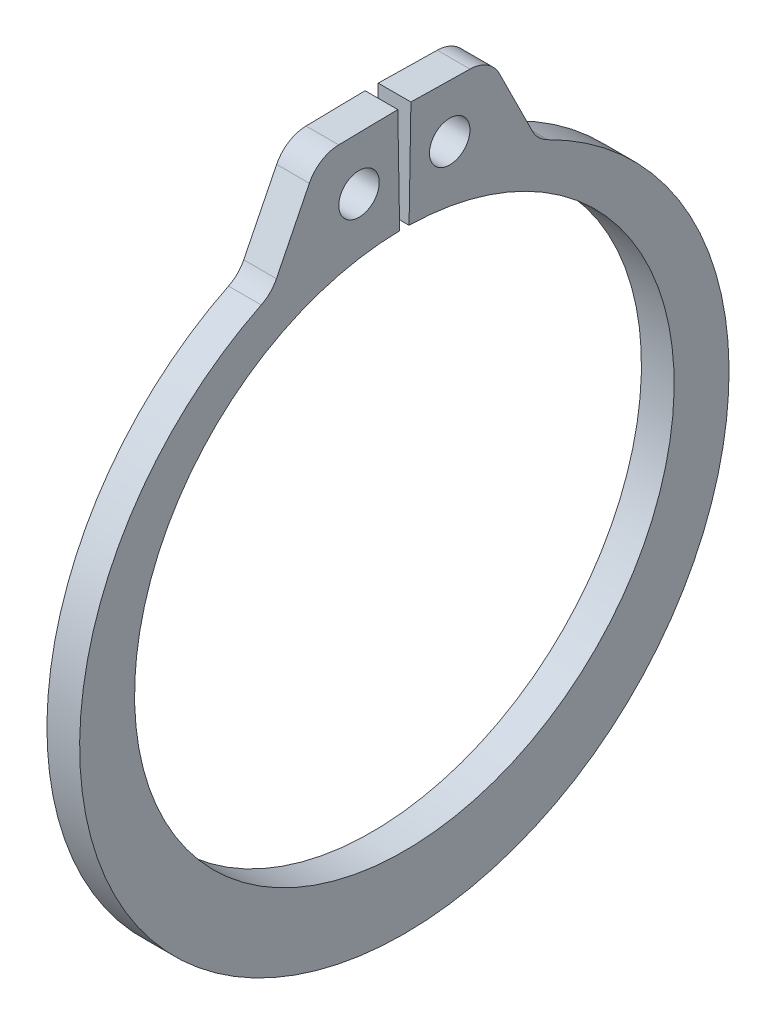
ISO-10303-21;
HEADER;
FILE_DESCRIPTION(('STEP AP214'),'2;1');
FILE_NAME('part.step','',(''),(''),'','','');
FILE_SCHEMA(('AUTOMOTIVE_DESIGN { 1 0 10303 214 1 1 1 1 }'));
ENDSEC;
DATA;
#1=APPLICATION_CONTEXT('core data for automotive mechanical design processes');
#2=APPLICATION_PROTOCOL_DEFINITION('international standard','automotive_design',2000,#1);
#3=PRODUCT_CONTEXT('',#1,'mechanical');
#4=PRODUCT('Part','Part','',(#3));
#5=PRODUCT_RELATED_PRODUCT_CATEGORY('part','',(#4));
#6=PRODUCT_DEFINITION_FORMATION('','',#4);
#7=PRODUCT_DEFINITION_CONTEXT('part definition',#1,'design');
#8=PRODUCT_DEFINITION('design','',#6,#7);
#9=PRODUCT_DEFINITION_SHAPE('','',#8);
#10=(LENGTH_UNIT() NAMED_UNIT(*) SI_UNIT(.MILLI.,.METRE.));
#11=(NAMED_UNIT(*) PLANE_ANGLE_UNIT() SI_UNIT($,.RADIAN.));
#12=(NAMED_UNIT(*) SI_UNIT($,.STERADIAN.) SOLID_ANGLE_UNIT());
#13=UNCERTAINTY_MEASURE_WITH_UNIT(LENGTH_MEASURE(1.E-05),#10,'distance_accuracy_value','');
#14=(GEOMETRIC_REPRESENTATION_CONTEXT(3) GLOBAL_UNCERTAINTY_ASSIGNED_CONTEXT((#13)) GLOBAL_UNIT_ASSIGNED_CONTEXT((#10,
#11,#12)) REPRESENTATION_CONTEXT('',''));
#15=CARTESIAN_POINT('',(0.,0.,0.));
#16=DIRECTION('',(0.,0.,1.));
#17=DIRECTION('',(1.,0.,0.));
#18=AXIS2_PLACEMENT_3D('',#15,#16,#17);
#19=CARTESIAN_POINT('',(-0.5334,0.,0.));
#20=DIRECTION('',(1.,0.,0.));
#21=DIRECTION('',(0.,0.,-1.));
#22=AXIS2_PLACEMENT_3D('',#19,#20,#21);
#23=PLANE('',#22);
#24=CARTESIAN_POINT('',(-0.5334,10.5040886416162,-1.47894687499924));
#25=DIRECTION('',(-1.,0.,0.));
#26=DIRECTION('',(0.,0.,1.));
#27=AXIS2_PLACEMENT_3D('',#24,#25,#26);
#28=CIRCLE('',#27,0.6604);
#29=CARTESIAN_POINT('',(-0.5334,10.5040886416162,-0.818546874999241));
#30=VERTEX_POINT('',#29);
#31=EDGE_CURVE('E133',#30,#30,#28,.F.);
#32=ORIENTED_EDGE('',*,*,#31,.T.);
#33=EDGE_LOOP('',(#32));
#34=FACE_BOUND('',#33,.T.);
#35=CARTESIAN_POINT('',(-0.5334,11.1279661301002,2.12169669403658));
#36=DIRECTION('',(-1.,0.,0.));
#37=DIRECTION('',(0.,0.,1.));
#38=AXIS2_PLACEMENT_3D('',#35,#36,#37);
#39=CIRCLE('',#38,1.0922);
#40=CARTESIAN_POINT('',(-0.5334,12.21999978275,2.14075821234738));
#41=VERTEX_POINT('',#40);
#42=CARTESIAN_POINT('',(-0.5334,11.6141614114107,3.09971253666458));
#43=VERTEX_POINT('',#42);
#44=EDGE_CURVE('E103',#41,#43,#39,.F.);
#45=ORIENTED_EDGE('',*,*,#44,.F.);
#46=DIRECTION('',(0.,0.0174524064372834,-0.999847695156391));
#47=VECTOR('',#46,1.);
#48=CARTESIAN_POINT('',(-0.5334,12.2536334279892,0.213887967092128));
#49=LINE('',#48,#47);
#50=CARTESIAN_POINT('',(-0.5334,12.2536334279892,0.213887967092128));
#51=VERTEX_POINT('',#50);
#52=EDGE_CURVE('E98',#41,#51,#49,.T.);
#53=ORIENTED_EDGE('',*,*,#52,.T.);
#54=DIRECTION('',(0.,-0.999847695156391,-0.0174524064372835));
#55=VECTOR('',#54,1.);
#56=CARTESIAN_POINT('',(-0.5334,8.79975954984091,0.153600374295176));
#57=LINE('',#56,#55);
#58=CARTESIAN_POINT('',(-0.5334,8.79975954984092,0.153600374295176));
#59=VERTEX_POINT('',#58);
#60=EDGE_CURVE('E130',#51,#59,#57,.T.);
#61=ORIENTED_EDGE('',*,*,#60,.T.);
#62=CARTESIAN_POINT('',(-0.5334,0.,0.));
#63=DIRECTION('',(-1.,0.,0.));
#64=DIRECTION('',(0.,0.,1.));
#65=AXIS2_PLACEMENT_3D('',#62,#63,#64);
#66=CIRCLE('',#65,8.8011);
#67=CARTESIAN_POINT('',(-0.5334,8.79975954984092,-0.153600374295176));
#68=VERTEX_POINT('',#67);
#69=EDGE_CURVE('E180',#59,#68,#66,.F.);
#70=ORIENTED_EDGE('',*,*,#69,.T.);
#71=DIRECTION('',(0.,0.999847695156391,-0.0174524064372835));
#72=VECTOR('',#71,1.);
#73=CARTESIAN_POINT('',(-0.5334,8.79975954984091,-0.153600374295176));
#74=LINE('',#73,#72);
#75=CARTESIAN_POINT('',(-0.5334,12.2536334279892,-0.213887967092128));
#76=VERTEX_POINT('',#75);
#77=EDGE_CURVE('E140',#68,#76,#74,.T.);
#78=ORIENTED_EDGE('',*,*,#77,.T.);
#79=DIRECTION('',(0.,-0.0174524064372834,-0.999847695156391));
#80=VECTOR('',#79,1.);
#81=CARTESIAN_POINT('',(-0.5334,12.2536334279892,-0.213887967092128));
#82=LINE('',#81,#80);
#83=CARTESIAN_POINT('',(-0.5334,12.21999978275,-2.14075821234738));
#84=VERTEX_POINT('',#83);
#85=EDGE_CURVE('E147',#76,#84,#82,.T.);
#86=ORIENTED_EDGE('',*,*,#85,.T.);
#87=CARTESIAN_POINT('',(-0.5334,11.1279661301002,-2.12169669403658));
#88=DIRECTION('',(-1.,0.,0.));
#89=DIRECTION('',(0.,0.,1.));
#90=AXIS2_PLACEMENT_3D('',#87,#88,#89);
#91=CIRCLE('',#90,1.0922);
#92=CARTESIAN_POINT('',(-0.5334,11.6141614114107,-3.09971253666458));
#93=VERTEX_POINT('',#92);
#94=EDGE_CURVE('E150',#93,#84,#91,.F.);
#95=ORIENTED_EDGE('',*,*,#94,.F.);
#96=DIRECTION('',(0.,-0.895454900776411,-0.445152244378829));
#97=VECTOR('',#96,1.);
#98=CARTESIAN_POINT('',(-0.5334,12.2084177333914,-2.80429337570331));
#99=LINE('',#98,#97);
#100=CARTESIAN_POINT('',(-0.5334,9.45539137797145,-4.17288922557434));
#101=VERTEX_POINT('',#100);
#102=EDGE_CURVE('E153',#93,#101,#99,.T.);
#103=ORIENTED_EDGE('',*,*,#102,.T.);
#104=CARTESIAN_POINT('',(-0.5334,9.941586659282,-5.15090506820234));
#105=DIRECTION('',(-1.,0.,0.));
#106=DIRECTION('',(0.,0.,1.));
#107=AXIS2_PLACEMENT_3D('',#104,#105,#106);
#108=CIRCLE('',#107,1.0922);
#109=CARTESIAN_POINT('',(-0.5334,8.96124610534802,-4.66941442622431));
#110=VERTEX_POINT('',#109);
#111=EDGE_CURVE('E186',#101,#110,#108,.F.);
#112=ORIENTED_EDGE('',*,*,#111,.T.);
#113=CARTESIAN_POINT('',(-0.5334,-0.545929997486656,0.));
#114=DIRECTION('',(-1.,0.,0.));
#115=DIRECTION('',(0.,0.,1.));
#116=AXIS2_PLACEMENT_3D('',#113,#114,#115);
#117=CIRCLE('',#116,10.5919700025133);
#118=CARTESIAN_POINT('',(-0.5334,8.96124610534802,4.66941442622431));
#119=VERTEX_POINT('',#118);
#120=EDGE_CURVE('E188',#119,#110,#117,.F.);
#121=ORIENTED_EDGE('',*,*,#120,.F.);
#122=CARTESIAN_POINT('',(-0.5334,9.941586659282,5.15090506820234));
#123=DIRECTION('',(-1.,0.,0.));
#124=DIRECTION('',(0.,0.,1.));
#125=AXIS2_PLACEMENT_3D('',#122,#123,#124);
#126=CIRCLE('',#125,1.0922);
#127=CARTESIAN_POINT('',(-0.5334,9.45539137797145,4.17288922557434));
#128=VERTEX_POINT('',#127);
#129=EDGE_CURVE('E116',#119,#128,#126,.F.);
#130=ORIENTED_EDGE('',*,*,#129,.T.);
#131=DIRECTION('',(0.,0.895454900776411,-0.445152244378829));
#132=VECTOR('',#131,1.);
#133=CARTESIAN_POINT('',(-0.5334,12.2084177333914,2.80429337570331));
#134=LINE('',#133,#132);
#135=EDGE_CURVE('E113',#128,#43,#134,.T.);
#136=ORIENTED_EDGE('',*,*,#135,.T.);
#137=EDGE_LOOP('',(#45,#53,#61,#70,#78,#86,#95,#103,#112,#121,#130,#136));
#138=FACE_BOUND('',#137,.T.);
#139=CARTESIAN_POINT('',(-0.5334,10.5040886416162,1.47894687499924));
#140=DIRECTION('',(-1.,0.,0.));
#141=DIRECTION('',(0.,0.,1.));
#142=AXIS2_PLACEMENT_3D('',#139,#140,#141);
#143=CIRCLE('',#142,0.6604);
#144=CARTESIAN_POINT('',(-0.5334,10.5040886416162,2.13934687499924));
#145=VERTEX_POINT('',#144);
#146=EDGE_CURVE('E20',#145,#145,#143,.F.);
#147=ORIENTED_EDGE('',*,*,#146,.T.);
#148=EDGE_LOOP('',(#147));
#149=FACE_BOUND('',#148,.T.);
#150=ADVANCED_FACE('F17',(#34,#138,#149),#23,.F.);
#151=CARTESIAN_POINT('',(0.5334,10.5040886416162,1.47894687499924));
#152=DIRECTION('',(-1.,0.,0.));
#153=DIRECTION('',(0.,0.,1.));
#154=AXIS2_PLACEMENT_3D('',#151,#152,#153);
#155=CYLINDRICAL_SURFACE('',#154,0.6604);
#156=CARTESIAN_POINT('',(0.5334,10.5040886416162,1.47894687499924));
#157=DIRECTION('',(-1.,0.,0.));
#158=DIRECTION('',(0.,0.,1.));
#159=AXIS2_PLACEMENT_3D('',#156,#157,#158);
#160=CIRCLE('',#159,0.6604);
#161=CARTESIAN_POINT('',(0.5334,10.5040886416162,2.13934687499924));
#162=VERTEX_POINT('',#161);
#163=EDGE_CURVE('E175',#162,#162,#160,.T.);
#164=ORIENTED_EDGE('',*,*,#163,.F.);
#165=EDGE_LOOP('',(#164));
#166=FACE_BOUND('',#165,.T.);
#167=ORIENTED_EDGE('',*,*,#146,.F.);
#168=EDGE_LOOP('',(#167));
#169=FACE_BOUND('',#168,.T.);
#170=ADVANCED_FACE('F388',(#166,#169),#155,.F.);
#171=CARTESIAN_POINT('',(0.5334,12.2536334279892,0.213887967092128));
#172=DIRECTION('',(0.,-0.999847695156391,-0.0174524064372834));
#173=DIRECTION('',(0.,0.0174524064372834,-0.999847695156391));
#174=AXIS2_PLACEMENT_3D('',#171,#172,#173);
#175=PLANE('',#174);
#176=DIRECTION('',(-1.,0.,0.));
#177=VECTOR('',#176,1.);
#178=CARTESIAN_POINT('',(0.5334,12.21999978275,2.14075821234738));
#179=LINE('',#178,#177);
#180=CARTESIAN_POINT('',(0.5334,12.21999978275,2.14075821234738));
#181=VERTEX_POINT('',#180);
#182=EDGE_CURVE('E110',#181,#41,#179,.T.);
#183=ORIENTED_EDGE('',*,*,#182,.F.);
#184=DIRECTION('',(0.,-0.0174524064372837,0.999847695156391));
#185=VECTOR('',#184,1.);
#186=CARTESIAN_POINT('',(0.5334,12.2536334279892,0.213887967092128));
#187=LINE('',#186,#185);
#188=CARTESIAN_POINT('',(0.5334,12.2536334279892,0.213887967092128));
#189=VERTEX_POINT('',#188);
#190=EDGE_CURVE('E174',#189,#181,#187,.T.);
#191=ORIENTED_EDGE('',*,*,#190,.F.);
#192=DIRECTION('',(1.,0.,0.));
#193=VECTOR('',#192,1.);
#194=CARTESIAN_POINT('',(0.5334,12.2536334279892,0.213887967092128));
#195=LINE('',#194,#193);
#196=EDGE_CURVE('E134',#189,#51,#195,.F.);
#197=ORIENTED_EDGE('',*,*,#196,.T.);
#198=ORIENTED_EDGE('',*,*,#52,.F.);
#199=EDGE_LOOP('',(#183,#191,#197,#198));
#200=FACE_BOUND('',#199,.T.);
#201=ADVANCED_FACE('F238',(#200),#175,.F.);
#202=CARTESIAN_POINT('',(0.5334,11.1279661301002,2.12169669403658));
#203=DIRECTION('',(-1.,0.,0.));
#204=DIRECTION('',(0.,0.,1.));
#205=AXIS2_PLACEMENT_3D('',#202,#203,#204);
#206=CYLINDRICAL_SURFACE('',#205,1.0922);
#207=ORIENTED_EDGE('',*,*,#44,.T.);
#208=DIRECTION('',(1.,0.,0.));
#209=VECTOR('',#208,1.);
#210=CARTESIAN_POINT('',(0.5334,11.6141614114107,3.09971253666458));
#211=LINE('',#210,#209);
#212=CARTESIAN_POINT('',(0.5334,11.6141614114107,3.09971253666458));
#213=VERTEX_POINT('',#212);
#214=EDGE_CURVE('E108',#43,#213,#211,.T.);
#215=ORIENTED_EDGE('',*,*,#214,.T.);
#216=CARTESIAN_POINT('',(0.5334,11.1279661301002,2.12169669403658));
#217=DIRECTION('',(-1.,0.,0.));
#218=DIRECTION('',(0.,0.,1.));
#219=AXIS2_PLACEMENT_3D('',#216,#217,#218);
#220=CIRCLE('',#219,1.0922);
#221=EDGE_CURVE('E172',#181,#213,#220,.F.);
#222=ORIENTED_EDGE('',*,*,#221,.F.);
#223=ORIENTED_EDGE('',*,*,#182,.T.);
#224=EDGE_LOOP('',(#207,#215,#222,#223));
#225=FACE_BOUND('',#224,.T.);
#226=ADVANCED_FACE('F105',(#225),#206,.T.);
#227=CARTESIAN_POINT('',(0.5334,12.2084177333914,2.80429337570331));
#228=DIRECTION('',(0.,-0.445152244378829,-0.895454900776411));
#229=DIRECTION('',(0.,0.895454900776411,-0.445152244378829));
#230=AXIS2_PLACEMENT_3D('',#227,#228,#229);
#231=PLANE('',#230);
#232=DIRECTION('',(-1.,0.,0.));
#233=VECTOR('',#232,1.);
#234=CARTESIAN_POINT('',(0.5334,9.45539137797145,4.17288922557434));
#235=LINE('',#234,#233);
#236=CARTESIAN_POINT('',(0.5334,9.45539137797145,4.17288922557434));
#237=VERTEX_POINT('',#236);
#238=EDGE_CURVE('E127',#128,#237,#235,.F.);
#239=ORIENTED_EDGE('',*,*,#238,.T.);
#240=DIRECTION('',(0.,-0.895454900776411,0.445152244378828));
#241=VECTOR('',#240,1.);
#242=CARTESIAN_POINT('',(0.5334,11.6141614114107,3.09971253666458));
#243=LINE('',#242,#241);
#244=EDGE_CURVE('E122',#213,#237,#243,.T.);
#245=ORIENTED_EDGE('',*,*,#244,.F.);
#246=ORIENTED_EDGE('',*,*,#214,.F.);
#247=ORIENTED_EDGE('',*,*,#135,.F.);
#248=EDGE_LOOP('',(#239,#245,#246,#247));
#249=FACE_BOUND('',#248,.T.);
#250=ADVANCED_FACE('F120',(#249),#231,.F.);
#251=CARTESIAN_POINT('',(0.5334,9.941586659282,5.15090506820234));
#252=DIRECTION('',(-1.,0.,0.));
#253=DIRECTION('',(0.,0.,1.));
#254=AXIS2_PLACEMENT_3D('',#251,#252,#253);
#255=CYLINDRICAL_SURFACE('',#254,1.0922);
#256=ORIENTED_EDGE('',*,*,#238,.F.);
#257=ORIENTED_EDGE('',*,*,#129,.F.);
#258=DIRECTION('',(-1.,0.,0.));
#259=VECTOR('',#258,1.);
#260=CARTESIAN_POINT('',(0.5334,8.96124610534802,4.66941442622431));
#261=LINE('',#260,#259);
#262=CARTESIAN_POINT('',(0.5334,8.96124610534802,4.66941442622431));
#263=VERTEX_POINT('',#262);
#264=EDGE_CURVE('E191',#263,#119,#261,.T.);
#265=ORIENTED_EDGE('',*,*,#264,.F.);
#266=CARTESIAN_POINT('',(0.5334,9.941586659282,5.15090506820234));
#267=DIRECTION('',(-1.,0.,0.));
#268=DIRECTION('',(0.,0.,1.));
#269=AXIS2_PLACEMENT_3D('',#266,#267,#268);
#270=CIRCLE('',#269,1.0922);
#271=EDGE_CURVE('E169',#237,#263,#270,.T.);
#272=ORIENTED_EDGE('',*,*,#271,.F.);
#273=EDGE_LOOP('',(#256,#257,#265,#272));
#274=FACE_BOUND('',#273,.T.);
#275=ADVANCED_FACE('F268',(#274),#255,.F.);
#276=CARTESIAN_POINT('',(0.5334,-0.545929997486656,0.));
#277=DIRECTION('',(-1.,0.,0.));
#278=DIRECTION('',(0.,0.,1.));
#279=AXIS2_PLACEMENT_3D('',#276,#277,#278);
#280=CYLINDRICAL_SURFACE('',#279,10.5919700025133);
#281=ORIENTED_EDGE('',*,*,#120,.T.);
#282=DIRECTION('',(-1.,0.,0.));
#283=VECTOR('',#282,1.);
#284=CARTESIAN_POINT('',(0.5334,8.96124610534802,-4.66941442622431));
#285=LINE('',#284,#283);
#286=CARTESIAN_POINT('',(0.5334,8.96124610534802,-4.66941442622431));
#287=VERTEX_POINT('',#286);
#288=EDGE_CURVE('E155',#110,#287,#285,.F.);
#289=ORIENTED_EDGE('',*,*,#288,.T.);
#290=CARTESIAN_POINT('',(0.5334,-0.545929997486656,0.));
#291=DIRECTION('',(-1.,0.,0.));
#292=DIRECTION('',(0.,0.,1.));
#293=AXIS2_PLACEMENT_3D('',#290,#291,#292);
#294=CIRCLE('',#293,10.5919700025133);
#295=EDGE_CURVE('E167',#263,#287,#294,.F.);
#296=ORIENTED_EDGE('',*,*,#295,.F.);
#297=ORIENTED_EDGE('',*,*,#264,.T.);
#298=EDGE_LOOP('',(#281,#289,#296,#297));
#299=FACE_BOUND('',#298,.T.);
#300=ADVANCED_FACE('F266',(#299),#280,.T.);
#301=CARTESIAN_POINT('',(0.5334,9.941586659282,-5.15090506820234));
#302=DIRECTION('',(-1.,0.,0.));
#303=DIRECTION('',(0.,0.,1.));
#304=AXIS2_PLACEMENT_3D('',#301,#302,#303);
#305=CYLINDRICAL_SURFACE('',#304,1.0922);
#306=ORIENTED_EDGE('',*,*,#288,.F.);
#307=ORIENTED_EDGE('',*,*,#111,.F.);
#308=DIRECTION('',(1.,0.,0.));
#309=VECTOR('',#308,1.);
#310=CARTESIAN_POINT('',(0.5334,9.45539137797145,-4.17288922557434));
#311=LINE('',#310,#309);
#312=CARTESIAN_POINT('',(0.5334,9.45539137797145,-4.17288922557434));
#313=VERTEX_POINT('',#312);
#314=EDGE_CURVE('E154',#101,#313,#311,.T.);
#315=ORIENTED_EDGE('',*,*,#314,.T.);
#316=CARTESIAN_POINT('',(0.5334,9.941586659282,-5.15090506820234));
#317=DIRECTION('',(-1.,0.,0.));
#318=DIRECTION('',(0.,0.,1.));
#319=AXIS2_PLACEMENT_3D('',#316,#317,#318);
#320=CIRCLE('',#319,1.0922);
#321=EDGE_CURVE('E164',#287,#313,#320,.T.);
#322=ORIENTED_EDGE('',*,*,#321,.F.);
#323=EDGE_LOOP('',(#306,#307,#315,#322));
#324=FACE_BOUND('',#323,.T.);
#325=ADVANCED_FACE('F264',(#324),#305,.F.);
#326=CARTESIAN_POINT('',(0.5334,12.2084177333914,-2.80429337570331));
#327=DIRECTION('',(0.,-0.445152244378829,0.895454900776411));
#328=DIRECTION('',(0.,-0.895454900776411,-0.445152244378829));
#329=AXIS2_PLACEMENT_3D('',#326,#327,#328);
#330=PLANE('',#329);
#331=ORIENTED_EDGE('',*,*,#314,.F.);
#332=ORIENTED_EDGE('',*,*,#102,.F.);
#333=DIRECTION('',(-1.,0.,0.));
#334=VECTOR('',#333,1.);
#335=CARTESIAN_POINT('',(0.5334,11.6141614114107,-3.09971253666458));
#336=LINE('',#335,#334);
#337=CARTESIAN_POINT('',(0.5334,11.6141614114107,-3.09971253666458));
#338=VERTEX_POINT('',#337);
#339=EDGE_CURVE('E185',#338,#93,#336,.T.);
#340=ORIENTED_EDGE('',*,*,#339,.F.);
#341=DIRECTION('',(0.,0.895454900776411,0.445152244378828));
#342=VECTOR('',#341,1.);
#343=CARTESIAN_POINT('',(0.5334,9.45539137797145,-4.17288922557434));
#344=LINE('',#343,#342);
#345=EDGE_CURVE('E163',#313,#338,#344,.T.);
#346=ORIENTED_EDGE('',*,*,#345,.F.);
#347=EDGE_LOOP('',(#331,#332,#340,#346));
#348=FACE_BOUND('',#347,.T.);
#349=ADVANCED_FACE('F260',(#348),#330,.F.);
#350=CARTESIAN_POINT('',(0.5334,11.1279661301002,-2.12169669403658));
#351=DIRECTION('',(-1.,0.,0.));
#352=DIRECTION('',(0.,0.,1.));
#353=AXIS2_PLACEMENT_3D('',#350,#351,#352);
#354=CYLINDRICAL_SURFACE('',#353,1.0922);
#355=ORIENTED_EDGE('',*,*,#94,.T.);
#356=DIRECTION('',(1.,0.,0.));
#357=VECTOR('',#356,1.);
#358=CARTESIAN_POINT('',(0.5334,12.21999978275,-2.14075821234738));
#359=LINE('',#358,#357);
#360=CARTESIAN_POINT('',(0.5334,12.21999978275,-2.14075821234738));
#361=VERTEX_POINT('',#360);
#362=EDGE_CURVE('E149',#84,#361,#359,.T.);
#363=ORIENTED_EDGE('',*,*,#362,.T.);
#364=CARTESIAN_POINT('',(0.5334,11.1279661301002,-2.12169669403658));
#365=DIRECTION('',(-1.,0.,0.));
#366=DIRECTION('',(0.,0.,1.));
#367=AXIS2_PLACEMENT_3D('',#364,#365,#366);
#368=CIRCLE('',#367,1.0922);
#369=EDGE_CURVE('E159',#338,#361,#368,.F.);
#370=ORIENTED_EDGE('',*,*,#369,.F.);
#371=ORIENTED_EDGE('',*,*,#339,.T.);
#372=EDGE_LOOP('',(#355,#363,#370,#371));
#373=FACE_BOUND('',#372,.T.);
#374=ADVANCED_FACE('F255',(#373),#354,.T.);
#375=CARTESIAN_POINT('',(0.5334,12.2536334279892,-0.213887967092128));
#376=DIRECTION('',(0.,-0.999847695156391,0.0174524064372834));
#377=DIRECTION('',(0.,-0.0174524064372834,-0.999847695156391));
#378=AXIS2_PLACEMENT_3D('',#375,#376,#377);
#379=PLANE('',#378);
#380=ORIENTED_EDGE('',*,*,#362,.F.);
#381=ORIENTED_EDGE('',*,*,#85,.F.);
#382=DIRECTION('',(1.,0.,0.));
#383=VECTOR('',#382,1.);
#384=CARTESIAN_POINT('',(0.5334,12.2536334279892,-0.213887967092128));
#385=LINE('',#384,#383);
#386=CARTESIAN_POINT('',(0.5334,12.2536334279892,-0.213887967092128));
#387=VERTEX_POINT('',#386);
#388=EDGE_CURVE('E144',#76,#387,#385,.T.);
#389=ORIENTED_EDGE('',*,*,#388,.T.);
#390=DIRECTION('',(0.,0.0174524064372837,0.999847695156391));
#391=VECTOR('',#390,1.);
#392=CARTESIAN_POINT('',(0.5334,12.21999978275,-2.14075821234738));
#393=LINE('',#392,#391);
#394=EDGE_CURVE('E162',#361,#387,#393,.T.);
#395=ORIENTED_EDGE('',*,*,#394,.F.);
#396=EDGE_LOOP('',(#380,#381,#389,#395));
#397=FACE_BOUND('',#396,.T.);
#398=ADVANCED_FACE('F252',(#397),#379,.F.);
#399=CARTESIAN_POINT('',(0.5334,8.79975954984091,-0.153600374295176));
#400=DIRECTION('',(0.,-0.0174524064372835,-0.999847695156391));
#401=DIRECTION('',(0.,0.999847695156391,-0.0174524064372835));
#402=AXIS2_PLACEMENT_3D('',#399,#400,#401);
#403=PLANE('',#402);
#404=DIRECTION('',(-1.,0.,0.));
#405=VECTOR('',#404,1.);
#406=CARTESIAN_POINT('',(0.5334,8.79975954984092,-0.153600374295176));
#407=LINE('',#406,#405);
#408=CARTESIAN_POINT('',(0.5334,8.79975954984092,-0.153600374295176));
#409=VERTEX_POINT('',#408);
#410=EDGE_CURVE('E143',#68,#409,#407,.F.);
#411=ORIENTED_EDGE('',*,*,#410,.T.);
#412=DIRECTION('',(0.,-0.999847695156391,0.0174524064372835));
#413=VECTOR('',#412,1.);
#414=CARTESIAN_POINT('',(0.5334,12.2536334279892,-0.213887967092128));
#415=LINE('',#414,#413);
#416=EDGE_CURVE('E158',#387,#409,#415,.T.);
#417=ORIENTED_EDGE('',*,*,#416,.F.);
#418=ORIENTED_EDGE('',*,*,#388,.F.);
#419=ORIENTED_EDGE('',*,*,#77,.F.);
#420=EDGE_LOOP('',(#411,#417,#418,#419));
#421=FACE_BOUND('',#420,.T.);
#422=ADVANCED_FACE('F244',(#421),#403,.F.);
#423=CARTESIAN_POINT('',(0.5334,0.,0.));
#424=DIRECTION('',(-1.,0.,0.));
#425=DIRECTION('',(0.,0.,1.));
#426=AXIS2_PLACEMENT_3D('',#423,#424,#425);
#427=CYLINDRICAL_SURFACE('',#426,8.8011);
#428=DIRECTION('',(1.,0.,0.));
#429=VECTOR('',#428,1.);
#430=CARTESIAN_POINT('',(0.5334,8.79975954984091,0.153600374295176));
#431=LINE('',#430,#429);
#432=CARTESIAN_POINT('',(0.5334,8.79975954984092,0.153600374295176));
#433=VERTEX_POINT('',#432);
#434=EDGE_CURVE('E182',#59,#433,#431,.T.);
#435=ORIENTED_EDGE('',*,*,#434,.T.);
#436=CARTESIAN_POINT('',(0.5334,0.,0.));
#437=DIRECTION('',(-1.,0.,0.));
#438=DIRECTION('',(0.,0.,1.));
#439=AXIS2_PLACEMENT_3D('',#436,#437,#438);
#440=CIRCLE('',#439,8.8011);
#441=EDGE_CURVE('E35',#409,#433,#440,.T.);
#442=ORIENTED_EDGE('',*,*,#441,.F.);
#443=ORIENTED_EDGE('',*,*,#410,.F.);
#444=ORIENTED_EDGE('',*,*,#69,.F.);
#445=EDGE_LOOP('',(#435,#442,#443,#444));
#446=FACE_BOUND('',#445,.T.);
#447=ADVANCED_FACE('F246',(#446),#427,.F.);
#448=CARTESIAN_POINT('',(0.5334,8.79975954984091,0.153600374295176));
#449=DIRECTION('',(0.,-0.0174524064372835,0.999847695156391));
#450=DIRECTION('',(0.,-0.999847695156391,-0.0174524064372835));
#451=AXIS2_PLACEMENT_3D('',#448,#449,#450);
#452=PLANE('',#451);
#453=ORIENTED_EDGE('',*,*,#196,.F.);
#454=DIRECTION('',(0.,0.999847695156391,0.0174524064372835));
#455=VECTOR('',#454,1.);
#456=CARTESIAN_POINT('',(0.5334,8.79975954984091,0.153600374295176));
#457=LINE('',#456,#455);
#458=EDGE_CURVE('E26',#433,#189,#457,.T.);
#459=ORIENTED_EDGE('',*,*,#458,.F.);
#460=ORIENTED_EDGE('',*,*,#434,.F.);
#461=ORIENTED_EDGE('',*,*,#60,.F.);
#462=EDGE_LOOP('',(#453,#459,#460,#461));
#463=FACE_BOUND('',#462,.T.);
#464=ADVANCED_FACE('F236',(#463),#452,.F.);
#465=CARTESIAN_POINT('',(0.5334,10.5040886416162,-1.47894687499924));
#466=DIRECTION('',(-1.,0.,0.));
#467=DIRECTION('',(0.,0.,1.));
#468=AXIS2_PLACEMENT_3D('',#465,#466,#467);
#469=CYLINDRICAL_SURFACE('',#468,0.6604);
#470=CARTESIAN_POINT('',(0.5334,10.5040886416162,-1.47894687499924));
#471=DIRECTION('',(-1.,0.,0.));
#472=DIRECTION('',(0.,0.,1.));
#473=AXIS2_PLACEMENT_3D('',#470,#471,#472);
#474=CIRCLE('',#473,0.6604);
#475=CARTESIAN_POINT('',(0.5334,10.5040886416162,-0.818546874999241));
#476=VERTEX_POINT('',#475);
#477=EDGE_CURVE('E11',#476,#476,#474,.T.);
#478=ORIENTED_EDGE('',*,*,#477,.F.);
#479=EDGE_LOOP('',(#478));
#480=FACE_BOUND('',#479,.T.);
#481=ORIENTED_EDGE('',*,*,#31,.F.);
#482=EDGE_LOOP('',(#481));
#483=FACE_BOUND('',#482,.T.);
#484=ADVANCED_FACE('F279',(#480,#483),#469,.F.);
#485=CARTESIAN_POINT('',(0.5334,0.,0.));
#486=DIRECTION('',(1.,0.,0.));
#487=DIRECTION('',(0.,0.,-1.));
#488=AXIS2_PLACEMENT_3D('',#485,#486,#487);
#489=PLANE('',#488);
#490=ORIENTED_EDGE('',*,*,#477,.T.);
#491=EDGE_LOOP('',(#490));
#492=FACE_BOUND('',#491,.T.);
#493=ORIENTED_EDGE('',*,*,#441,.T.);
#494=ORIENTED_EDGE('',*,*,#458,.T.);
#495=ORIENTED_EDGE('',*,*,#190,.T.);
#496=ORIENTED_EDGE('',*,*,#221,.T.);
#497=ORIENTED_EDGE('',*,*,#244,.T.);
#498=ORIENTED_EDGE('',*,*,#271,.T.);
#499=ORIENTED_EDGE('',*,*,#295,.T.);
#500=ORIENTED_EDGE('',*,*,#321,.T.);
#501=ORIENTED_EDGE('',*,*,#345,.T.);
#502=ORIENTED_EDGE('',*,*,#369,.T.);
#503=ORIENTED_EDGE('',*,*,#394,.T.);
#504=ORIENTED_EDGE('',*,*,#416,.T.);
#505=EDGE_LOOP('',(#493,#494,#495,#496,#497,#498,#499,#500,#501,#502,#503,#504));
#506=FACE_BOUND('',#505,.T.);
#507=ORIENTED_EDGE('',*,*,#163,.T.);
#508=EDGE_LOOP('',(#507));
#509=FACE_BOUND('',#508,.T.);
#510=ADVANCED_FACE('F229',(#492,#506,#509),#489,.T.);
#511=CLOSED_SHELL('',(#150,#170,#201,#226,#250,#275,#300,#325,#349,#374,#398,#422,#447,#464,
#484,#510));
#512=MANIFOLD_SOLID_BREP('B1',#511);
#513=ADVANCED_BREP_SHAPE_REPRESENTATION('',(#18,#512),#14);
#514=SHAPE_DEFINITION_REPRESENTATION(#9,#513);
ENDSEC;
END-ISO-10303-21;
